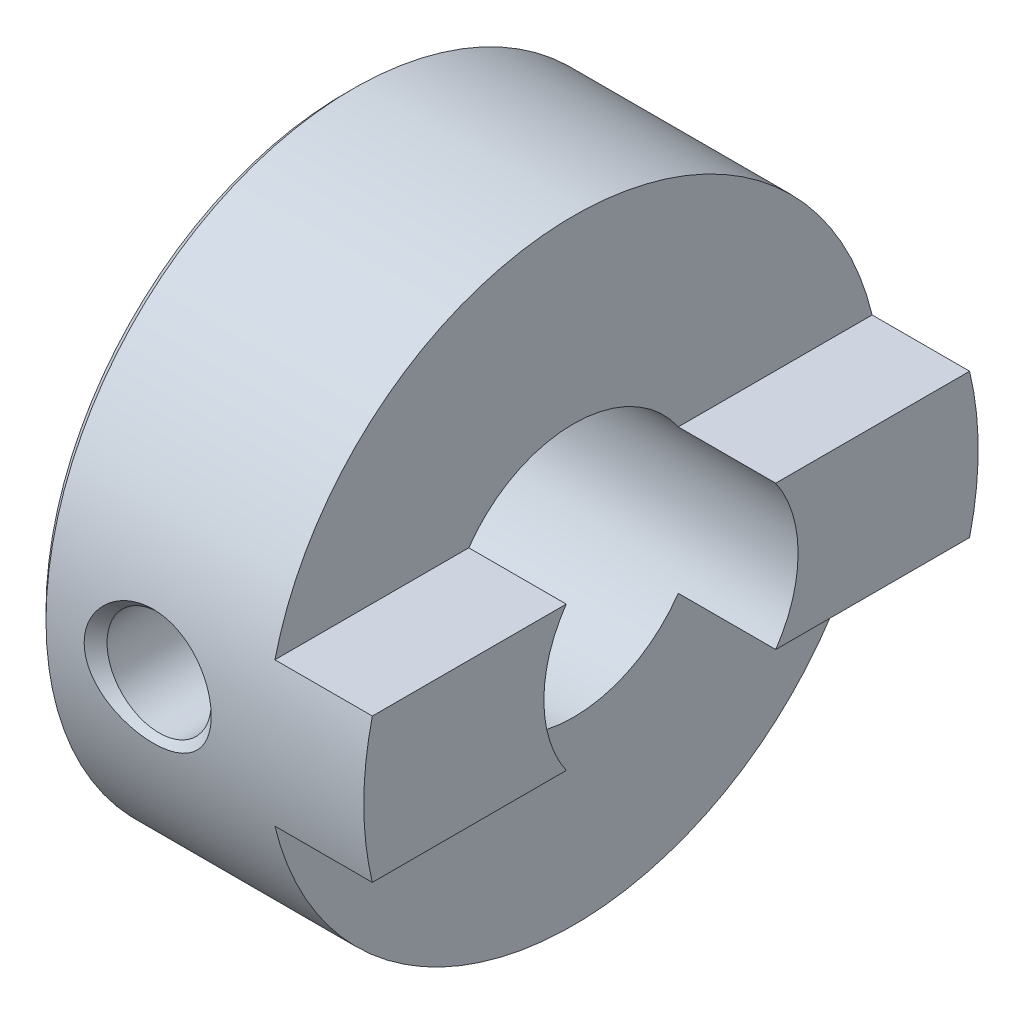
ISO-10303-21;
HEADER;
FILE_DESCRIPTION(('STEP AP214'),'2;1');
FILE_NAME('part.step','',(''),(''),'','','');
FILE_SCHEMA(('AUTOMOTIVE_DESIGN { 1 0 10303 214 1 1 1 1 }'));
ENDSEC;
DATA;
#1=APPLICATION_CONTEXT('core data for automotive mechanical design processes');
#2=APPLICATION_PROTOCOL_DEFINITION('international standard','automotive_design',2000,#1);
#3=PRODUCT_CONTEXT('',#1,'mechanical');
#4=PRODUCT('Part','Part','',(#3));
#5=PRODUCT_RELATED_PRODUCT_CATEGORY('part','',(#4));
#6=PRODUCT_DEFINITION_FORMATION('','',#4);
#7=PRODUCT_DEFINITION_CONTEXT('part definition',#1,'design');
#8=PRODUCT_DEFINITION('design','',#6,#7);
#9=PRODUCT_DEFINITION_SHAPE('','',#8);
#10=(LENGTH_UNIT() NAMED_UNIT(*) SI_UNIT(.MILLI.,.METRE.));
#11=(NAMED_UNIT(*) PLANE_ANGLE_UNIT() SI_UNIT($,.RADIAN.));
#12=(NAMED_UNIT(*) SI_UNIT($,.STERADIAN.) SOLID_ANGLE_UNIT());
#13=UNCERTAINTY_MEASURE_WITH_UNIT(LENGTH_MEASURE(1.E-05),#10,'distance_accuracy_value','');
#14=(GEOMETRIC_REPRESENTATION_CONTEXT(3) GLOBAL_UNCERTAINTY_ASSIGNED_CONTEXT((#13)) GLOBAL_UNIT_ASSIGNED_CONTEXT((#10,
#11,#12)) REPRESENTATION_CONTEXT('',''));
#15=CARTESIAN_POINT('',(0.,0.,0.));
#16=DIRECTION('',(0.,0.,1.));
#17=DIRECTION('',(1.,0.,0.));
#18=AXIS2_PLACEMENT_3D('',#15,#16,#17);
#19=CARTESIAN_POINT('',(7.7,0.,0.));
#20=DIRECTION('',(-1.,0.,0.));
#21=DIRECTION('',(0.,0.,1.));
#22=AXIS2_PLACEMENT_3D('',#19,#20,#21);
#23=CYLINDRICAL_SURFACE('',#22,3.);
#24=CARTESIAN_POINT('',(3.8295,0.,3.));
#25=CARTESIAN_POINT('',(3.82949328569729,-0.0659514535856203,2.99999498511311));
#26=CARTESIAN_POINT('',(3.82416188908903,-0.132011203774949,2.99779986227982));
#27=CARTESIAN_POINT('',(3.80302356475284,-0.262262647630673,2.98923181084605));
#28=CARTESIAN_POINT('',(3.78718881892747,-0.326448906785996,2.98284778843995));
#29=CARTESIAN_POINT('',(3.7457227192484,-0.450857222468448,2.96658875911719));
#30=CARTESIAN_POINT('',(3.72012409906108,-0.511091744949063,2.9567254249085));
#31=CARTESIAN_POINT('',(3.6599898195502,-0.626354649209973,2.93447272972049));
#32=CARTESIAN_POINT('',(3.62545703015189,-0.681384695087921,2.92208418018727));
#33=CARTESIAN_POINT('',(3.54664932062834,-0.78745356945694,2.89534823924166));
#34=CARTESIAN_POINT('',(3.50200813761405,-0.838204317616565,2.88093806799954));
#35=CARTESIAN_POINT('',(3.40502464860071,-0.931744853904246,2.85206114140614));
#36=CARTESIAN_POINT('',(3.35267843290376,-0.974530575298185,2.83759436097932));
#37=CARTESIAN_POINT('',(3.23877096037323,-1.05292091176569,2.80947961237513));
#38=CARTESIAN_POINT('',(3.17689120749616,-1.08809082515892,2.79590260625976));
#39=CARTESIAN_POINT('',(3.04745599561159,-1.14739431537322,2.77209579358365));
#40=CARTESIAN_POINT('',(2.97990338613743,-1.17153339430377,2.76186431901926));
#41=CARTESIAN_POINT('',(2.84435405685637,-1.20691045759755,2.74658421903306));
#42=CARTESIAN_POINT('',(2.77652760676489,-1.21870174053509,2.7413144936938));
#43=CARTESIAN_POINT('',(2.63966988744342,-1.23077568317597,2.73591659015033));
#44=CARTESIAN_POINT('',(2.57063927130691,-1.23106439849153,2.73578570656521));
#45=CARTESIAN_POINT('',(2.43876188563989,-1.22054280844032,2.74049253289023));
#46=CARTESIAN_POINT('',(2.37583434370652,-1.21054899967416,2.74496473839223));
#47=CARTESIAN_POINT('',(2.25264353626367,-1.18111223614475,2.7577579098135));
#48=CARTESIAN_POINT('',(2.19238076402581,-1.16166753986357,2.76607958506211));
#49=CARTESIAN_POINT('',(2.07473555597421,-1.1135051701494,2.78582002200623));
#50=CARTESIAN_POINT('',(2.01743983646983,-1.08460188146217,2.79729997649603));
#51=CARTESIAN_POINT('',(1.90829392084931,-1.01847361536098,2.82204815766591));
#52=CARTESIAN_POINT('',(1.8564458429203,-0.98124541847393,2.8353170753973));
#53=CARTESIAN_POINT('',(1.75521936998315,-0.895960018736876,2.86346450373987));
#54=CARTESIAN_POINT('',(1.70638673460735,-0.847267490537693,2.87838605601125));
#55=CARTESIAN_POINT('',(1.61740071573172,-0.742231634591019,2.90724204561816));
#56=CARTESIAN_POINT('',(1.57724923612441,-0.68588663295727,2.92117626596914));
#57=CARTESIAN_POINT('',(1.50600022647194,-0.565532668884167,2.94686865754846));
#58=CARTESIAN_POINT('',(1.47511776165605,-0.501384081860799,2.95857312748741));
#59=CARTESIAN_POINT('',(1.42477268422351,-0.368200328119309,2.97807769320191));
#60=CARTESIAN_POINT('',(1.40530397172419,-0.299167793691064,2.98587987416027));
#61=CARTESIAN_POINT('',(1.37946533079553,-0.162742348037352,2.99631517713848));
#62=CARTESIAN_POINT('',(1.37236256394674,-0.0955102741162197,2.99923703991062));
#63=CARTESIAN_POINT('',(1.36928128616072,0.0392426816075557,3.00049911766206));
#64=CARTESIAN_POINT('',(1.37329971205089,0.106763478770608,2.99884059424314));
#65=CARTESIAN_POINT('',(1.39181608520372,0.23679122112461,2.99131629784099));
#66=CARTESIAN_POINT('',(1.40580538199463,0.299383745656252,2.98565483728674));
#67=CARTESIAN_POINT('',(1.44316504071889,0.421269379771582,2.97090953103081));
#68=CARTESIAN_POINT('',(1.46653659677266,0.480562068276792,2.96182524970108));
#69=CARTESIAN_POINT('',(1.52276145063507,0.596230291018692,2.94076075800053));
#70=CARTESIAN_POINT('',(1.55588543647673,0.652459057517629,2.92869973207055));
#71=CARTESIAN_POINT('',(1.63037634033654,0.758760050709084,2.9029776109099));
#72=CARTESIAN_POINT('',(1.67174664717916,0.808829732601657,2.88931585881557));
#73=CARTESIAN_POINT('',(1.76490985805959,0.905031595838981,2.86070072959535));
#74=CARTESIAN_POINT('',(1.81722602257037,0.950651248882355,2.84572340909333));
#75=CARTESIAN_POINT('',(1.9290213940975,1.03259972531423,2.81702464968191));
#76=CARTESIAN_POINT('',(1.98850203231412,1.06892668781994,2.80330346266884));
#77=CARTESIAN_POINT('',(2.11402435079571,1.13158082456849,2.77861081388899));
#78=CARTESIAN_POINT('',(2.18013767424438,1.15777963115296,2.76767521401346));
#79=CARTESIAN_POINT('',(2.31642433649718,1.19845804973928,2.75030847354089));
#80=CARTESIAN_POINT('',(2.38659442725865,1.21294690178531,2.74387378192563));
#81=CARTESIAN_POINT('',(2.52333604792641,1.22889032551675,2.73676775095077));
#82=CARTESIAN_POINT('',(2.5897831564595,1.23124035133271,2.73570062793635));
#83=CARTESIAN_POINT('',(2.72208198363542,1.2252138393541,2.73840503500129));
#84=CARTESIAN_POINT('',(2.78793378545201,1.21683882409304,2.74217587828009));
#85=CARTESIAN_POINT('',(2.91422254722324,1.19034373537945,2.75377473340919));
#86=CARTESIAN_POINT('',(2.97477041948495,1.17266424718385,2.76141877653731));
#87=CARTESIAN_POINT('',(3.09205888491998,1.12848502186667,2.77976449429752));
#88=CARTESIAN_POINT('',(3.14879841030321,1.10198282333109,2.79046702208636));
#89=CARTESIAN_POINT('',(3.26050986673883,1.0391075640444,2.81450713105456));
#90=CARTESIAN_POINT('',(3.31518009342289,1.00224445147623,2.82796290964367));
#91=CARTESIAN_POINT('',(3.41783936132136,0.920392371525509,2.85565105030456));
#92=CARTESIAN_POINT('',(3.465826199865,0.875400736363273,2.86988366626076));
#93=CARTESIAN_POINT('',(3.5571832521007,0.774853209283579,2.89871006864603));
#94=CARTESIAN_POINT('',(3.60000102144758,0.718780498579465,2.91326023791293));
#95=CARTESIAN_POINT('',(3.6756405737496,0.599700811693502,2.94008128893798));
#96=CARTESIAN_POINT('',(3.7084577713653,0.536690672617394,2.95235112414249));
#97=CARTESIAN_POINT('',(3.7624274628876,0.406581660855322,2.97303819539227));
#98=CARTESIAN_POINT('',(3.78377377969354,0.339573482807291,2.98151900992786));
#99=CARTESIAN_POINT('',(3.81470588327966,0.202622479051472,2.99393275040676));
#100=CARTESIAN_POINT('',(3.82432870245358,0.132689619716405,2.99787999479812));
#101=CARTESIAN_POINT('',(3.82897175289518,0.0417015292291354,2.99978415049652));
#102=CARTESIAN_POINT('',(3.82950212329973,0.0208561797038032,3.00000158588441));
#103=CARTESIAN_POINT('',(3.8295,0.,3.));
#104=B_SPLINE_CURVE_WITH_KNOTS('',3,(#24,#25,#26,#27,#28,#29,#30,#31,#32,#33,#34,#35,#36,#37,
#38,#39,#40,#41,#42,#43,#44,#45,#46,#47,#48,#49,#50,#51,#52,#53,#54,#55,#56,#57,#58,#59,#60,#61,
#62,#63,#64,#65,#66,#67,#68,#69,#70,#71,#72,#73,#74,#75,#76,#77,#78,#79,#80,#81,#82,#83,#84,#85,
#86,#87,#88,#89,#90,#91,#92,#93,#94,#95,#96,#97,#98,#99,#100,#101,#102,#103),.UNSPECIFIED.,.T.,
.F.,(4,2,2,2,2,2,2,2,2,2,2,2,2,2,2,2,2,2,2,2,2,2,2,2,2,2,2,2,2,2,2,2,2,2,2,2,2,2,2,4),(0.,
0.197796476848555,0.39611892017699,0.593782244182593,0.791382151420799,0.997808518364824,
1.20433999386331,1.42062773745645,1.63680748003642,1.84282127729825,2.04872661563105,
2.23945548299843,2.43021950936491,2.62497735172079,2.81981064299796,3.03052449908558,
3.24128452074389,3.45661193569793,3.67182416748392,3.87378277467297,4.07568576080444,
4.26796477319144,4.46026826551681,4.65851435705458,4.85684208638467,5.06889934237754,
5.28099903014245,5.49570509764268,5.71024157987188,5.90870001466507,6.10713027929823,
6.29691314897361,6.48674900987517,6.68778307817334,6.88888324607283,7.10395632066562,
7.3191278600644,7.53053919959828,7.74128098311942,7.80383121729397),.UNSPECIFIED.);
#105=CARTESIAN_POINT('',(3.8295,0.,3.));
#106=VERTEX_POINT('',#105);
#107=EDGE_CURVE('E147',#106,#106,#104,.T.);
#108=ORIENTED_EDGE('',*,*,#107,.F.);
#109=EDGE_LOOP('',(#108));
#110=FACE_BOUND('',#109,.T.);
#111=CARTESIAN_POINT('',(0.,0.,0.));
#112=DIRECTION('',(-1.,0.,0.));
#113=DIRECTION('',(0.,0.,1.));
#114=AXIS2_PLACEMENT_3D('',#111,#112,#113);
#115=CIRCLE('',#114,3.);
#116=CARTESIAN_POINT('',(0.,0.,3.));
#117=VERTEX_POINT('',#116);
#118=EDGE_CURVE('E200',#117,#117,#115,.T.);
#119=ORIENTED_EDGE('',*,*,#118,.T.);
#120=EDGE_LOOP('',(#119));
#121=FACE_BOUND('',#120,.T.);
#122=DIRECTION('',(-1.,0.,0.));
#123=VECTOR('',#122,1.);
#124=CARTESIAN_POINT('',(7.7,1.7,-2.47184141886166));
#125=LINE('',#124,#123);
#126=CARTESIAN_POINT('',(5.4,1.7,-2.47184141886166));
#127=VERTEX_POINT('',#126);
#128=CARTESIAN_POINT('',(7.7,1.7,-2.47184141886166));
#129=VERTEX_POINT('',#128);
#130=EDGE_CURVE('E215',#127,#129,#125,.F.);
#131=ORIENTED_EDGE('',*,*,#130,.F.);
#132=CARTESIAN_POINT('',(5.4,0.,0.));
#133=DIRECTION('',(1.,0.,0.));
#134=DIRECTION('',(0.,0.,-1.));
#135=AXIS2_PLACEMENT_3D('',#132,#133,#134);
#136=CIRCLE('',#135,3.);
#137=CARTESIAN_POINT('',(5.4,1.7,2.47184141886165));
#138=VERTEX_POINT('',#137);
#139=EDGE_CURVE('E213',#138,#127,#136,.F.);
#140=ORIENTED_EDGE('',*,*,#139,.F.);
#141=DIRECTION('',(-1.,0.,0.));
#142=VECTOR('',#141,1.);
#143=CARTESIAN_POINT('',(7.7,1.7,2.47184141886166));
#144=LINE('',#143,#142);
#145=CARTESIAN_POINT('',(7.7,1.7,2.47184141886165));
#146=VERTEX_POINT('',#145);
#147=EDGE_CURVE('E217',#146,#138,#144,.T.);
#148=ORIENTED_EDGE('',*,*,#147,.F.);
#149=CARTESIAN_POINT('',(7.7,0.,0.));
#150=DIRECTION('',(-1.,0.,0.));
#151=DIRECTION('',(0.,0.,1.));
#152=AXIS2_PLACEMENT_3D('',#149,#150,#151);
#153=CIRCLE('',#152,3.);
#154=CARTESIAN_POINT('',(7.7,-1.7,2.47184141886166));
#155=VERTEX_POINT('',#154);
#156=EDGE_CURVE('E113',#155,#146,#153,.T.);
#157=ORIENTED_EDGE('',*,*,#156,.F.);
#158=DIRECTION('',(-1.,0.,0.));
#159=VECTOR('',#158,1.);
#160=CARTESIAN_POINT('',(7.7,-1.7,2.47184141886166));
#161=LINE('',#160,#159);
#162=CARTESIAN_POINT('',(5.4,-1.7,2.47184141886166));
#163=VERTEX_POINT('',#162);
#164=EDGE_CURVE('E122',#163,#155,#161,.F.);
#165=ORIENTED_EDGE('',*,*,#164,.F.);
#166=CARTESIAN_POINT('',(5.4,-1.7,-2.47184141886165));
#167=VERTEX_POINT('',#166);
#168=EDGE_CURVE('E212',#167,#163,#136,.F.);
#169=ORIENTED_EDGE('',*,*,#168,.F.);
#170=DIRECTION('',(-1.,0.,0.));
#171=VECTOR('',#170,1.);
#172=CARTESIAN_POINT('',(7.7,-1.7,-2.47184141886166));
#173=LINE('',#172,#171);
#174=CARTESIAN_POINT('',(7.7,-1.7,-2.47184141886165));
#175=VERTEX_POINT('',#174);
#176=EDGE_CURVE('E220',#175,#167,#173,.T.);
#177=ORIENTED_EDGE('',*,*,#176,.F.);
#178=EDGE_CURVE('E205',#129,#175,#153,.T.);
#179=ORIENTED_EDGE('',*,*,#178,.F.);
#180=EDGE_LOOP('',(#131,#140,#148,#157,#165,#169,#177,#179));
#181=FACE_BOUND('',#180,.T.);
#182=CARTESIAN_POINT('',(2.6,-2.73648127163334,-1.2295));
#183=CARTESIAN_POINT('',(2.53431241312503,-2.73648780956102,-1.22949315138636));
#184=CARTESIAN_POINT('',(2.46851319422433,-2.73888081381414,-1.22420253559425));
#185=CARTESIAN_POINT('',(2.33880712336176,-2.74815082242326,-1.20324134105429));
#186=CARTESIAN_POINT('',(2.27490599449168,-2.7550401822636,-1.18754215883488));
#187=CARTESIAN_POINT('',(2.15110367085302,-2.77238055395693,-1.14647156088477));
#188=CARTESIAN_POINT('',(2.09118763557545,-2.78281735069028,-1.1211387013557));
#189=CARTESIAN_POINT('',(1.97647410931836,-2.80605632232373,-1.06163271912682));
#190=CARTESIAN_POINT('',(1.92167529633033,-2.81885788373942,-1.02746188831969));
#191=CARTESIAN_POINT('',(1.81542071817095,-2.84624576616181,-0.949051485785524));
#192=CARTESIAN_POINT('',(1.76431030640095,-2.86089134904967,-0.904364397367615));
#193=CARTESIAN_POINT('',(1.67005477725144,-2.88982909756545,-0.80713037140368));
#194=CARTESIAN_POINT('',(1.62691267328353,-2.90412112772637,-0.754580473886261));
#195=CARTESIAN_POINT('',(1.54807767891041,-2.93145772839144,-0.640419420006656));
#196=CARTESIAN_POINT('',(1.51277069726217,-2.9444253707679,-0.578521678763456));
#197=CARTESIAN_POINT('',(1.45321911786677,-2.96692984694733,-0.449038294588409));
#198=CARTESIAN_POINT('',(1.42896976063041,-2.9764681564497,-0.381455113683014));
#199=CARTESIAN_POINT('',(1.39346522892795,-2.9906193808634,-0.246142515052299));
#200=CARTESIAN_POINT('',(1.3816152416405,-2.99545687164545,-0.178593132993614));
#201=CARTESIAN_POINT('',(1.36932659878579,-3.00047548879171,-0.0423030743211912));
#202=CARTESIAN_POINT('',(1.36888347302489,-3.00065843920655,0.0264371250591211));
#203=CARTESIAN_POINT('',(1.37910347278662,-2.99648142293689,0.158843065489902));
#204=CARTESIAN_POINT('',(1.38911381266895,-2.99238846675702,0.222569172880482));
#205=CARTESIAN_POINT('',(1.41884116729122,-2.98048340348736,0.347344524354358));
#206=CARTESIAN_POINT('',(1.43855889625975,-2.97267102273945,0.408393571110869));
#207=CARTESIAN_POINT('',(1.48737939882473,-2.9539364025768,0.527194669373116));
#208=CARTESIAN_POINT('',(1.51662024657542,-2.94296870578276,0.584882515233401));
#209=CARTESIAN_POINT('',(1.58352419889611,-2.91900300610779,0.694682900248777));
#210=CARTESIAN_POINT('',(1.62119024594535,-2.90600429437943,0.746793482135163));
#211=CARTESIAN_POINT('',(1.70687880484473,-2.87823614609434,0.847751806093453));
#212=CARTESIAN_POINT('',(1.7554340057339,-2.86340640811089,0.896131508323045));
#213=CARTESIAN_POINT('',(1.86001217848453,-2.8343238240614,0.984259463325257));
#214=CARTESIAN_POINT('',(1.91603783518033,-2.82007118781416,1.02400459932354));
#215=CARTESIAN_POINT('',(2.03616162862691,-2.7933344144319,1.09488169836433));
#216=CARTESIAN_POINT('',(2.10045577395076,-2.78091856857543,1.12570941449411));
#217=CARTESIAN_POINT('',(2.2339671151109,-2.76006895426521,1.17591116152427));
#218=CARTESIAN_POINT('',(2.30318088768675,-2.7516324474554,1.19529307110252));
#219=CARTESIAN_POINT('',(2.43988472631904,-2.74036973715095,1.22088420198514));
#220=CARTESIAN_POINT('',(2.50720623298238,-2.7372219875884,1.22785010777662));
#221=CARTESIAN_POINT('',(2.64211522756041,-2.73597518687805,1.23062760982761));
#222=CARTESIAN_POINT('',(2.70970262107327,-2.73787448144216,1.22644286097673));
#223=CARTESIAN_POINT('',(2.83888111137191,-2.74617645512611,1.20772776335379));
#224=CARTESIAN_POINT('',(2.90058637573323,-2.75229712124247,1.19384461620143));
#225=CARTESIAN_POINT('',(3.02074503827775,-2.76799616906696,1.15697694064485));
#226=CARTESIAN_POINT('',(3.07919768916748,-2.77757534161818,1.13399033047091));
#227=CARTESIAN_POINT('',(3.19390961953353,-2.79959890680042,1.07850341271678));
#228=CARTESIAN_POINT('',(3.24997620702377,-2.81214600076601,1.0456468007359));
#229=CARTESIAN_POINT('',(3.35606374580067,-2.83854133304941,0.971711039083268));
#230=CARTESIAN_POINT('',(3.40608212845281,-2.85239011978126,0.930628415410735));
#231=CARTESIAN_POINT('',(3.50272532461655,-2.88113667186629,0.837614583671576));
#232=CARTESIAN_POINT('',(3.54877820631948,-2.89603171091513,0.785085978357612));
#233=CARTESIAN_POINT('',(3.63151251873588,-2.92418051506077,0.672696462266431));
#234=CARTESIAN_POINT('',(3.66819339332496,-2.93743418273639,0.612835116684309));
#235=CARTESIAN_POINT('',(3.7310606384906,-2.9608738194617,0.487147930636997));
#236=CARTESIAN_POINT('',(3.7572328303714,-2.97105563929166,0.421314177733732));
#237=CARTESIAN_POINT('',(3.79794757318709,-2.98714826285554,0.28565560556214));
#238=CARTESIAN_POINT('',(3.81249679524442,-2.99306151638861,0.215833100375171));
#239=CARTESIAN_POINT('',(3.82873243582459,-2.99967730668242,0.0793006171973768));
#240=CARTESIAN_POINT('',(3.83122615829686,-3.00070679242164,0.0127017932051536));
#241=CARTESIAN_POINT('',(3.8254344745692,-2.99833483648245,-0.119937680644486));
#242=CARTESIAN_POINT('',(3.81715085126267,-2.99493412768981,-0.185978421006613));
#243=CARTESIAN_POINT('',(3.79061851146278,-2.98425243348016,-0.313353500594179));
#244=CARTESIAN_POINT('',(3.77271264038092,-2.97710514384663,-0.374771382452148));
#245=CARTESIAN_POINT('',(3.72781230848352,-2.95970663025144,-0.493713482444952));
#246=CARTESIAN_POINT('',(3.70081609297552,-2.94945480706587,-0.551236946270739));
#247=CARTESIAN_POINT('',(3.63714322694257,-2.92627386768644,-0.663595981273957));
#248=CARTESIAN_POINT('',(3.60008674047484,-2.91324530347192,-0.718195321073256));
#249=CARTESIAN_POINT('',(3.51790587513661,-2.88606626558856,-0.820630636830924));
#250=CARTESIAN_POINT('',(3.47277862443759,-2.87191539356856,-0.868464194428001));
#251=CARTESIAN_POINT('',(3.37225005788837,-2.84292750571023,-0.959261150448481));
#252=CARTESIAN_POINT('',(3.31636966936297,-2.82810618568879,-1.00170102773972));
#253=CARTESIAN_POINT('',(3.19780649473225,-2.8004263062305,-1.07666900848907));
#254=CARTESIAN_POINT('',(3.13511999885674,-2.78756882649604,-1.10919166926766));
#255=CARTESIAN_POINT('',(3.0050168237469,-2.76555425774474,-1.16299317926956));
#256=CARTESIAN_POINT('',(2.93763760992313,-2.7563710936226,-1.18435160089751));
#257=CARTESIAN_POINT('',(2.79987605050722,-2.74292337613586,-1.21518173856348));
#258=CARTESIAN_POINT('',(2.72950460802761,-2.73864232698964,-1.22469332912189));
#259=CARTESIAN_POINT('',(2.63929212566052,-2.73669093986595,-1.22903121983948));
#260=CARTESIAN_POINT('',(2.61965105815903,-2.7364793157509,-1.22950204882705));
#261=CARTESIAN_POINT('',(2.6,-2.73648127163334,-1.2295));
#262=B_SPLINE_CURVE_WITH_KNOTS('',3,(#182,#183,#184,#185,#186,#187,#188,#189,#190,#191,#192,
#193,#194,#195,#196,#197,#198,#199,#200,#201,#202,#203,#204,#205,#206,#207,#208,#209,#210,#211,
#212,#213,#214,#215,#216,#217,#218,#219,#220,#221,#222,#223,#224,#225,#226,#227,#228,#229,#230,
#231,#232,#233,#234,#235,#236,#237,#238,#239,#240,#241,#242,#243,#244,#245,#246,#247,#248,#249,
#250,#251,#252,#253,#254,#255,#256,#257,#258,#259,#260,#261),.UNSPECIFIED.,.T.,.F.,(4,2,2,2,2,2,
2,2,2,2,2,2,2,2,2,2,2,2,2,2,2,2,2,2,2,2,2,2,2,2,2,2,2,2,2,2,2,2,2,4),(0.,0.197007966215397,
0.394559580690225,0.591328730081259,0.788046903701635,0.995494474616981,1.20302033701821,
1.41920485860491,1.63529624071189,1.84046581601936,2.04555498694063,2.23856134929523,
2.43158191436346,2.62753588803081,2.8235584052722,3.03300883122902,3.24253473625559,
3.45853784628883,3.67439209755867,3.87657241302121,4.07868646727745,4.26846135135183,
4.45827965801603,4.65600225587178,4.85380853252234,5.06709525389456,5.28039462852351,
5.49398083506075,5.70744436335558,5.90639415816304,6.10531104494405,6.29756953893313,
6.48986516551972,6.69078450728953,6.89177548516159,7.10591887553852,7.32017957956198,
7.53289158239508,7.74488567905244,7.80382246126762),.UNSPECIFIED.);
#263=CARTESIAN_POINT('',(2.6,-2.73648127163334,-1.2295));
#264=VERTEX_POINT('',#263);
#265=EDGE_CURVE('E35',#264,#264,#262,.T.);
#266=ORIENTED_EDGE('',*,*,#265,.F.);
#267=EDGE_LOOP('',(#266));
#268=FACE_BOUND('',#267,.T.);
#269=ADVANCED_FACE('F31',(#110,#121,#181,#268),#23,.F.);
#270=CARTESIAN_POINT('',(7.7,0.,0.));
#271=DIRECTION('',(-1.,0.,0.));
#272=DIRECTION('',(0.,0.,1.));
#273=AXIS2_PLACEMENT_3D('',#270,#271,#272);
#274=CYLINDRICAL_SURFACE('',#273,7.25);
#275=CARTESIAN_POINT('',(1.58200830564529,-1.00441187640881,7.18008752364289));
#276=CARTESIAN_POINT('',(1.63578489278405,-1.04986168617137,7.17372987099769));
#277=CARTESIAN_POINT('',(1.69285744622883,-1.0914437843685,7.16747414093581));
#278=CARTESIAN_POINT('',(1.81228966583431,-1.16634368468239,7.15566782402923));
#279=CARTESIAN_POINT('',(1.87465392529839,-1.19965420638385,7.15011786046206));
#280=CARTESIAN_POINT('',(2.01679932362037,-1.26362766588196,7.13911876735613));
#281=CARTESIAN_POINT('',(2.09750518380208,-1.29229902644037,7.13393068599323));
#282=CARTESIAN_POINT('',(2.26255781731959,-1.33649004443632,7.12578417882237));
#283=CARTESIAN_POINT('',(2.34690619475528,-1.35200384414861,7.12282674616046));
#284=CARTESIAN_POINT('',(2.52065223150985,-1.36998996712848,7.11939043620564));
#285=CARTESIAN_POINT('',(2.61011263231742,-1.37188343237519,7.11902158797866));
#286=CARTESIAN_POINT('',(2.78811433738971,-1.36105760290706,7.12109896292041));
#287=CARTESIAN_POINT('',(2.87665557697855,-1.34833728684657,7.12354538284604));
#288=CARTESIAN_POINT('',(3.05121935555725,-1.30830613276614,7.13100637247181));
#289=CARTESIAN_POINT('',(3.13720746776744,-1.2808493751554,7.13604660507981));
#290=CARTESIAN_POINT('',(3.30315769567977,-1.21173912671794,7.14810554203639));
#291=CARTESIAN_POINT('',(3.38311937379568,-1.17008460618597,7.15512438987939));
#292=CARTESIAN_POINT('',(3.53281939111721,-1.07436014228975,7.17011449381119));
#293=CARTESIAN_POINT('',(3.60273478873325,-1.02056442954647,7.17806308179058));
#294=CARTESIAN_POINT('',(3.73168457584752,-0.901188410845225,7.19402326752565));
#295=CARTESIAN_POINT('',(3.79072313502557,-0.835612639940881,7.20203483990277));
#296=CARTESIAN_POINT('',(3.89176983510201,-0.699065767687178,7.21652215909619));
#297=CARTESIAN_POINT('',(3.9346557785529,-0.628753310889177,7.22306493275218));
#298=CARTESIAN_POINT('',(4.00658864830554,-0.481245793876791,7.23438650365962));
#299=CARTESIAN_POINT('',(4.03564736039825,-0.404056661946941,7.23916680239026));
#300=CARTESIAN_POINT('',(4.07618067207471,-0.253293693342394,7.24592730796786));
#301=CARTESIAN_POINT('',(4.08911394050319,-0.180121088254738,7.24813828678803));
#302=CARTESIAN_POINT('',(4.10176888975318,-0.0326184047054376,7.25030100569326));
#303=CARTESIAN_POINT('',(4.10149631308732,0.041711156601682,7.25025372777298));
#304=CARTESIAN_POINT('',(4.08820817586898,0.184383945543079,7.24798414988832));
#305=CARTESIAN_POINT('',(4.07600481823865,0.252807068196405,7.24590048292978));
#306=CARTESIAN_POINT('',(4.04060949728902,0.386657988093955,7.23999211790296));
#307=CARTESIAN_POINT('',(4.01741713207762,0.452085675692575,7.23616735615924));
#308=CARTESIAN_POINT('',(3.96051204781662,0.579435634433251,7.22709524930008));
#309=CARTESIAN_POINT('',(3.92662374278215,0.64127736804729,7.22182436848898));
#310=CARTESIAN_POINT('',(3.8497192608264,0.758894573948918,7.21041449239855));
#311=CARTESIAN_POINT('',(3.80670040557847,0.814668258977202,7.20427524257127));
#312=CARTESIAN_POINT('',(3.70914137095142,0.923325338320132,7.19118919407236));
#313=CARTESIAN_POINT('',(3.65395734780279,0.975626981988899,7.18421698925729));
#314=CARTESIAN_POINT('',(3.53619073599058,1.07114619999515,7.17059821491746));
#315=CARTESIAN_POINT('',(3.47360525829482,1.11436020872209,7.16395177399041));
#316=CARTESIAN_POINT('',(3.33665332172002,1.19458953746153,7.15103215175697));
#317=CARTESIAN_POINT('',(3.26173286710323,1.23067513006905,7.14484885376223));
#318=CARTESIAN_POINT('',(3.10705718425124,1.29069806927207,7.13425045930504));
#319=CARTESIAN_POINT('',(3.02730052661362,1.31463180444377,7.12983588857469));
#320=CARTESIAN_POINT('',(2.8600321862052,1.35105018722601,7.12302843823919));
#321=CARTESIAN_POINT('',(2.77234356407695,1.36275222818191,7.1207744451249));
#322=CARTESIAN_POINT('',(2.59619523462123,1.37185894546039,7.11902547397831));
#323=CARTESIAN_POINT('',(2.50773540865226,1.36926138175978,7.11953092821143));
#324=CARTESIAN_POINT('',(2.33061126879319,1.34960613141039,7.12328338346153));
#325=CARTESIAN_POINT('',(2.24198131585001,1.33224738498813,7.12658745781934));
#326=CARTESIAN_POINT('',(2.06897237582656,1.28297633307368,7.13562151934399));
#327=CARTESIAN_POINT('',(1.98459381058273,1.25106258653289,7.14135174671321));
#328=CARTESIAN_POINT('',(1.82339727023525,1.17360665959709,7.15448608356551));
#329=CARTESIAN_POINT('',(1.74651841092376,1.12818895340395,7.16187475988556));
#330=CARTESIAN_POINT('',(1.60205504614399,1.02447186153392,7.17744361372084));
#331=CARTESIAN_POINT('',(1.53446899231729,0.966174626061896,7.18562365899105));
#332=CARTESIAN_POINT('',(1.41434197676091,0.841167557071238,7.20129836482031));
#333=CARTESIAN_POINT('',(1.36122070886127,0.775018991504764,7.20880689105407));
#334=CARTESIAN_POINT('',(1.26817419775783,0.63389110916314,7.22258155112997));
#335=CARTESIAN_POINT('',(1.22823870201042,0.558918715143412,7.22884864871574));
#336=CARTESIAN_POINT('',(1.16673090415709,0.409859581690512,7.23875387776177));
#337=CARTESIAN_POINT('',(1.1437848535595,0.336352629089151,7.2425838198878));
#338=CARTESIAN_POINT('',(1.11166697875233,0.186318789306052,7.24799293238601));
#339=CARTESIAN_POINT('',(1.10248608704101,0.109793924240928,7.2495735843946));
#340=CARTESIAN_POINT('',(1.09856708002886,-0.0371624105618861,7.2502458733885));
#341=CARTESIAN_POINT('',(1.10267880857037,-0.107564850675874,7.24953573502622));
#342=CARTESIAN_POINT('',(1.12266051183263,-0.246628476202496,7.24613765697439));
#343=CARTESIAN_POINT('',(1.1385305372985,-0.315289654099066,7.24344970874923));
#344=CARTESIAN_POINT('',(1.18105536096362,-0.44820883014545,7.23643532002251));
#345=CARTESIAN_POINT('',(1.20758616009768,-0.512507843662707,7.23212775367172));
#346=CARTESIAN_POINT('',(1.27036332146251,-0.636038184498317,7.22231246455589));
#347=CARTESIAN_POINT('',(1.30660754976289,-0.69527062112042,7.21680500544335));
#348=CARTESIAN_POINT('',(1.38084391813178,-0.79820968952281,7.20607963615762));
#349=CARTESIAN_POINT('',(1.4175529831974,-0.842863136661078,7.2009647742634));
#350=CARTESIAN_POINT('',(1.49610740984216,-0.927346361084062,7.19057295923222));
#351=CARTESIAN_POINT('',(1.5379517769681,-0.967177069335422,7.18529603762613));
#352=CARTESIAN_POINT('',(1.58200830564529,-1.00441187640881,7.18008752364289));
#353=B_SPLINE_CURVE_WITH_KNOTS('',3,(#275,#276,#277,#278,#279,#280,#281,#282,#283,#284,#285,
#286,#287,#288,#289,#290,#291,#292,#293,#294,#295,#296,#297,#298,#299,#300,#301,#302,#303,#304,
#305,#306,#307,#308,#309,#310,#311,#312,#313,#314,#315,#316,#317,#318,#319,#320,#321,#322,#323,
#324,#325,#326,#327,#328,#329,#330,#331,#332,#333,#334,#335,#336,#337,#338,#339,#340,#341,#342,
#343,#344,#345,#346,#347,#348,#349,#350,#351,#352),.UNSPECIFIED.,.T.,.F.,(4,2,2,2,2,2,2,2,2,2,2,
2,2,2,2,2,2,2,2,2,2,2,2,2,2,2,2,2,2,2,2,2,2,2,2,2,2,2,4),(0.,0.211938643284731,
0.424063173171912,0.680306178414661,0.936663202843584,1.20385421472871,1.47106390151892,
1.74096966424346,2.01089500628775,2.27524467692895,2.53949279622624,2.78598439679511,
3.03226551954191,3.25410969475752,3.47585740272509,3.68349073542137,3.89113166230997,
4.10237599855491,4.31368238639661,4.54177808574879,4.76996311408858,5.01903918441396,
5.268189234664,5.5324533792992,5.79675892190776,6.06658804235083,6.33644388359847,
6.60388559171092,6.87128268480002,7.12540591048332,7.37933107579475,7.60937608477173,
7.83926948987682,8.04982077901012,8.26037297682207,8.46854395674077,8.67666924128815,
8.85033378723575,9.02396475588732),.UNSPECIFIED.);
#354=CARTESIAN_POINT('',(1.58200830564529,-1.00441187640881,7.18008752364289));
#355=VERTEX_POINT('',#354);
#356=EDGE_CURVE('E44',#355,#355,#353,.T.);
#357=ORIENTED_EDGE('',*,*,#356,.F.);
#358=EDGE_LOOP('',(#357));
#359=FACE_BOUND('',#358,.T.);
#360=CARTESIAN_POINT('',(0.2,0.,0.));
#361=DIRECTION('',(-1.,0.,0.));
#362=DIRECTION('',(0.,0.,1.));
#363=AXIS2_PLACEMENT_3D('',#360,#361,#362);
#364=CIRCLE('',#363,7.25);
#365=CARTESIAN_POINT('',(0.2,0.,7.25));
#366=VERTEX_POINT('',#365);
#367=EDGE_CURVE('E209',#366,#366,#364,.T.);
#368=ORIENTED_EDGE('',*,*,#367,.F.);
#369=EDGE_LOOP('',(#368));
#370=FACE_BOUND('',#369,.T.);
#371=DIRECTION('',(-1.,0.,0.));
#372=VECTOR('',#371,1.);
#373=CARTESIAN_POINT('',(7.7,1.7,-7.04787201926936));
#374=LINE('',#373,#372);
#375=CARTESIAN_POINT('',(7.7,1.7,-7.04787201926936));
#376=VERTEX_POINT('',#375);
#377=CARTESIAN_POINT('',(5.4,1.7,-7.04787201926936));
#378=VERTEX_POINT('',#377);
#379=EDGE_CURVE('E139',#376,#378,#374,.T.);
#380=ORIENTED_EDGE('',*,*,#379,.F.);
#381=CARTESIAN_POINT('',(7.7,0.,0.));
#382=DIRECTION('',(-1.,0.,0.));
#383=DIRECTION('',(0.,0.,1.));
#384=AXIS2_PLACEMENT_3D('',#381,#382,#383);
#385=CIRCLE('',#384,7.25);
#386=CARTESIAN_POINT('',(7.7,-1.7,-7.04787201926936));
#387=VERTEX_POINT('',#386);
#388=EDGE_CURVE('E114',#376,#387,#385,.T.);
#389=ORIENTED_EDGE('',*,*,#388,.T.);
#390=DIRECTION('',(-1.,0.,0.));
#391=VECTOR('',#390,1.);
#392=CARTESIAN_POINT('',(7.7,-1.7,-7.04787201926936));
#393=LINE('',#392,#391);
#394=CARTESIAN_POINT('',(5.4,-1.7,-7.04787201926936));
#395=VERTEX_POINT('',#394);
#396=EDGE_CURVE('E135',#395,#387,#393,.F.);
#397=ORIENTED_EDGE('',*,*,#396,.F.);
#398=CARTESIAN_POINT('',(5.4,0.,0.));
#399=DIRECTION('',(1.,0.,0.));
#400=DIRECTION('',(0.,0.,-1.));
#401=AXIS2_PLACEMENT_3D('',#398,#399,#400);
#402=CIRCLE('',#401,7.25);
#403=CARTESIAN_POINT('',(5.4,-1.7,7.04787201926936));
#404=VERTEX_POINT('',#403);
#405=EDGE_CURVE('E130',#404,#395,#402,.T.);
#406=ORIENTED_EDGE('',*,*,#405,.F.);
#407=DIRECTION('',(-1.,0.,0.));
#408=VECTOR('',#407,1.);
#409=CARTESIAN_POINT('',(7.7,-1.7,7.04787201926936));
#410=LINE('',#409,#408);
#411=CARTESIAN_POINT('',(7.7,-1.7,7.04787201926936));
#412=VERTEX_POINT('',#411);
#413=EDGE_CURVE('E119',#412,#404,#410,.T.);
#414=ORIENTED_EDGE('',*,*,#413,.F.);
#415=CARTESIAN_POINT('',(7.7,1.7,7.04787201926936));
#416=VERTEX_POINT('',#415);
#417=EDGE_CURVE('E103',#412,#416,#385,.T.);
#418=ORIENTED_EDGE('',*,*,#417,.T.);
#419=DIRECTION('',(-1.,0.,0.));
#420=VECTOR('',#419,1.);
#421=CARTESIAN_POINT('',(7.7,1.7,7.04787201926936));
#422=LINE('',#421,#420);
#423=CARTESIAN_POINT('',(5.4,1.7,7.04787201926936));
#424=VERTEX_POINT('',#423);
#425=EDGE_CURVE('E131',#424,#416,#422,.F.);
#426=ORIENTED_EDGE('',*,*,#425,.F.);
#427=EDGE_CURVE('E133',#378,#424,#402,.T.);
#428=ORIENTED_EDGE('',*,*,#427,.F.);
#429=EDGE_LOOP('',(#380,#389,#397,#406,#414,#418,#426,#428));
#430=FACE_BOUND('',#429,.T.);
#431=CARTESIAN_POINT('',(1.58200830564529,-7.18008752364289,-1.00441187640881));
#432=CARTESIAN_POINT('',(1.63578489278405,-7.17372987099769,-1.04986168617137));
#433=CARTESIAN_POINT('',(1.69285744622883,-7.16747414093581,-1.0914437843685));
#434=CARTESIAN_POINT('',(1.81228966583431,-7.15566782402923,-1.16634368468239));
#435=CARTESIAN_POINT('',(1.87465392529839,-7.15011786046206,-1.19965420638385));
#436=CARTESIAN_POINT('',(2.01679932362037,-7.13911876735613,-1.26362766588195));
#437=CARTESIAN_POINT('',(2.09750518380208,-7.13393068599323,-1.29229902644037));
#438=CARTESIAN_POINT('',(2.26255781731959,-7.12578417882237,-1.33649004443632));
#439=CARTESIAN_POINT('',(2.34690619475528,-7.12282674616046,-1.35200384414861));
#440=CARTESIAN_POINT('',(2.52065223150985,-7.11939043620564,-1.36998996712848));
#441=CARTESIAN_POINT('',(2.61011263231742,-7.11902158797866,-1.37188343237519));
#442=CARTESIAN_POINT('',(2.78811433738971,-7.12109896292041,-1.36105760290706));
#443=CARTESIAN_POINT('',(2.87665557697855,-7.12354538284604,-1.34833728684657));
#444=CARTESIAN_POINT('',(3.05121935555725,-7.13100637247181,-1.30830613276614));
#445=CARTESIAN_POINT('',(3.13720746776744,-7.13604660507981,-1.2808493751554));
#446=CARTESIAN_POINT('',(3.30315769567977,-7.14810554203639,-1.21173912671794));
#447=CARTESIAN_POINT('',(3.38311937379568,-7.15512438987939,-1.17008460618597));
#448=CARTESIAN_POINT('',(3.5328193911172,-7.17011449381119,-1.07436014228975));
#449=CARTESIAN_POINT('',(3.60273478873325,-7.17806308179058,-1.02056442954647));
#450=CARTESIAN_POINT('',(3.73168457584752,-7.19402326752565,-0.901188410845225));
#451=CARTESIAN_POINT('',(3.79072313502557,-7.20203483990277,-0.835612639940882));
#452=CARTESIAN_POINT('',(3.89176983510201,-7.21652215909619,-0.699065767687178));
#453=CARTESIAN_POINT('',(3.9346557785529,-7.22306493275218,-0.628753310889178));
#454=CARTESIAN_POINT('',(4.00658864830554,-7.23438650365962,-0.481245793876792));
#455=CARTESIAN_POINT('',(4.03564736039825,-7.23916680239026,-0.404056661946942));
#456=CARTESIAN_POINT('',(4.07618067207471,-7.24592730796786,-0.253293693342395));
#457=CARTESIAN_POINT('',(4.08911394050318,-7.24813828678803,-0.180121088254738));
#458=CARTESIAN_POINT('',(4.10176888975318,-7.25030100569326,-0.0326184047054377));
#459=CARTESIAN_POINT('',(4.10149631308732,-7.25025372777298,0.0417111566016818));
#460=CARTESIAN_POINT('',(4.08820817586898,-7.24798414988832,0.184383945543078));
#461=CARTESIAN_POINT('',(4.07600481823865,-7.24590048292978,0.252807068196405));
#462=CARTESIAN_POINT('',(4.04060949728902,-7.23999211790296,0.386657988093955));
#463=CARTESIAN_POINT('',(4.01741713207762,-7.23616735615924,0.452085675692574));
#464=CARTESIAN_POINT('',(3.96051204781662,-7.22709524930008,0.579435634433251));
#465=CARTESIAN_POINT('',(3.92662374278215,-7.22182436848898,0.64127736804729));
#466=CARTESIAN_POINT('',(3.8497192608264,-7.21041449239855,0.758894573948917));
#467=CARTESIAN_POINT('',(3.80670040557847,-7.20427524257127,0.814668258977201));
#468=CARTESIAN_POINT('',(3.70914137095142,-7.19118919407236,0.923325338320132));
#469=CARTESIAN_POINT('',(3.65395734780279,-7.18421698925729,0.975626981988899));
#470=CARTESIAN_POINT('',(3.53619073599058,-7.17059821491746,1.07114619999515));
#471=CARTESIAN_POINT('',(3.47360525829482,-7.16395177399041,1.11436020872209));
#472=CARTESIAN_POINT('',(3.33665332172002,-7.15103215175697,1.19458953746153));
#473=CARTESIAN_POINT('',(3.26173286710323,-7.14484885376223,1.23067513006905));
#474=CARTESIAN_POINT('',(3.10705718425124,-7.13425045930504,1.29069806927207));
#475=CARTESIAN_POINT('',(3.02730052661362,-7.12983588857469,1.31463180444377));
#476=CARTESIAN_POINT('',(2.8600321862052,-7.12302843823919,1.35105018722601));
#477=CARTESIAN_POINT('',(2.77234356407695,-7.1207744451249,1.36275222818191));
#478=CARTESIAN_POINT('',(2.59619523462123,-7.11902547397831,1.37185894546039));
#479=CARTESIAN_POINT('',(2.50773540865226,-7.11953092821143,1.36926138175978));
#480=CARTESIAN_POINT('',(2.33061126879319,-7.12328338346153,1.34960613141039));
#481=CARTESIAN_POINT('',(2.24198131585001,-7.12658745781934,1.33224738498813));
#482=CARTESIAN_POINT('',(2.06897237582656,-7.13562151934399,1.28297633307368));
#483=CARTESIAN_POINT('',(1.98459381058273,-7.14135174671321,1.25106258653289));
#484=CARTESIAN_POINT('',(1.82339727023525,-7.15448608356551,1.17360665959709));
#485=CARTESIAN_POINT('',(1.74651841092376,-7.16187475988556,1.12818895340395));
#486=CARTESIAN_POINT('',(1.602055046144,-7.17744361372084,1.02447186153392));
#487=CARTESIAN_POINT('',(1.53446899231729,-7.18562365899105,0.966174626061897));
#488=CARTESIAN_POINT('',(1.41434197676091,-7.20129836482031,0.84116755707124));
#489=CARTESIAN_POINT('',(1.36122070886127,-7.20880689105407,0.775018991504765));
#490=CARTESIAN_POINT('',(1.26817419775783,-7.22258155112997,0.633891109163142));
#491=CARTESIAN_POINT('',(1.22823870201042,-7.22884864871574,0.558918715143413));
#492=CARTESIAN_POINT('',(1.16673090415709,-7.23875387776177,0.409859581690513));
#493=CARTESIAN_POINT('',(1.1437848535595,-7.2425838198878,0.336352629089152));
#494=CARTESIAN_POINT('',(1.11166697875233,-7.24799293238601,0.186318789306053));
#495=CARTESIAN_POINT('',(1.10248608704101,-7.2495735843946,0.109793924240929));
#496=CARTESIAN_POINT('',(1.09856708002886,-7.2502458733885,-0.0371624105618858));
#497=CARTESIAN_POINT('',(1.10267880857037,-7.24953573502622,-0.107564850675874));
#498=CARTESIAN_POINT('',(1.12266051183263,-7.24613765697439,-0.246628476202496));
#499=CARTESIAN_POINT('',(1.1385305372985,-7.24344970874923,-0.315289654099065));
#500=CARTESIAN_POINT('',(1.18105536096362,-7.23643532002251,-0.448208830145449));
#501=CARTESIAN_POINT('',(1.20758616009768,-7.23212775367172,-0.512507843662706));
#502=CARTESIAN_POINT('',(1.27036332146251,-7.22231246455589,-0.636038184498316));
#503=CARTESIAN_POINT('',(1.3066075497629,-7.21680500544335,-0.695270621120419));
#504=CARTESIAN_POINT('',(1.38084391813178,-7.20607963615762,-0.798209689522809));
#505=CARTESIAN_POINT('',(1.4175529831974,-7.2009647742634,-0.842863136661076));
#506=CARTESIAN_POINT('',(1.49610740984216,-7.19057295923222,-0.927346361084061));
#507=CARTESIAN_POINT('',(1.5379517769681,-7.18529603762613,-0.967177069335421));
#508=CARTESIAN_POINT('',(1.58200830564529,-7.18008752364289,-1.00441187640881));
#509=B_SPLINE_CURVE_WITH_KNOTS('',3,(#431,#432,#433,#434,#435,#436,#437,#438,#439,#440,#441,
#442,#443,#444,#445,#446,#447,#448,#449,#450,#451,#452,#453,#454,#455,#456,#457,#458,#459,#460,
#461,#462,#463,#464,#465,#466,#467,#468,#469,#470,#471,#472,#473,#474,#475,#476,#477,#478,#479,
#480,#481,#482,#483,#484,#485,#486,#487,#488,#489,#490,#491,#492,#493,#494,#495,#496,#497,#498,
#499,#500,#501,#502,#503,#504,#505,#506,#507,#508),.UNSPECIFIED.,.T.,.F.,(4,2,2,2,2,2,2,2,2,2,2,
2,2,2,2,2,2,2,2,2,2,2,2,2,2,2,2,2,2,2,2,2,2,2,2,2,2,2,4),(0.,0.211938643284731,
0.424063173171911,0.68030617841466,0.936663202843583,1.20385421472871,1.47106390151892,
1.74096966424346,2.01089500628775,2.27524467692895,2.53949279622623,2.78598439679511,
3.0322655195419,3.25410969475752,3.47585740272509,3.68349073542137,3.89113166230996,
4.10237599855491,4.31368238639661,4.54177808574879,4.76996311408858,5.01903918441396,
5.268189234664,5.53245337929919,5.79675892190776,6.06658804235083,6.33644388359846,
6.60388559171092,6.87128268480002,7.12540591048331,7.37933107579475,7.60937608477172,
7.83926948987682,8.04982077901012,8.26037297682207,8.46854395674077,8.67666924128815,
8.85033378723574,9.02396475588731),.UNSPECIFIED.);
#510=CARTESIAN_POINT('',(1.58200830564529,-7.18008752364289,-1.00441187640881));
#511=VERTEX_POINT('',#510);
#512=EDGE_CURVE('E11',#511,#511,#509,.T.);
#513=ORIENTED_EDGE('',*,*,#512,.F.);
#514=EDGE_LOOP('',(#513));
#515=FACE_BOUND('',#514,.T.);
#516=ADVANCED_FACE('F127',(#359,#370,#430,#515),#274,.T.);
#517=CARTESIAN_POINT('',(7.7,3.,0.));
#518=DIRECTION('',(-1.,0.,0.));
#519=DIRECTION('',(0.,0.,1.));
#520=AXIS2_PLACEMENT_3D('',#517,#518,#519);
#521=PLANE('',#520);
#522=DIRECTION('',(0.,0.,1.));
#523=VECTOR('',#522,1.);
#524=CARTESIAN_POINT('',(7.7,1.7,-7.25));
#525=LINE('',#524,#523);
#526=EDGE_CURVE('E109',#146,#416,#525,.T.);
#527=ORIENTED_EDGE('',*,*,#526,.T.);
#528=ORIENTED_EDGE('',*,*,#417,.F.);
#529=DIRECTION('',(0.,0.,-1.));
#530=VECTOR('',#529,1.);
#531=CARTESIAN_POINT('',(7.7,-1.7,7.25));
#532=LINE('',#531,#530);
#533=EDGE_CURVE('E107',#412,#155,#532,.T.);
#534=ORIENTED_EDGE('',*,*,#533,.T.);
#535=ORIENTED_EDGE('',*,*,#156,.T.);
#536=EDGE_LOOP('',(#527,#528,#534,#535));
#537=FACE_BOUND('',#536,.T.);
#538=ADVANCED_FACE('F105',(#537),#521,.F.);
#539=EDGE_CURVE('E224',#376,#129,#525,.T.);
#540=ORIENTED_EDGE('',*,*,#539,.T.);
#541=ORIENTED_EDGE('',*,*,#178,.T.);
#542=EDGE_CURVE('E123',#175,#387,#532,.T.);
#543=ORIENTED_EDGE('',*,*,#542,.T.);
#544=ORIENTED_EDGE('',*,*,#388,.F.);
#545=EDGE_LOOP('',(#540,#541,#543,#544));
#546=FACE_BOUND('',#545,.T.);
#547=ADVANCED_FACE('F195',(#546),#521,.F.);
#548=CARTESIAN_POINT('',(0.2,0.,0.));
#549=DIRECTION('',(1.,0.,0.));
#550=DIRECTION('',(0.,0.,-1.));
#551=AXIS2_PLACEMENT_3D('',#548,#549,#550);
#552=CONICAL_SURFACE('',#551,7.25,0.78539816339745);
#553=CARTESIAN_POINT('',(0.,0.,0.));
#554=DIRECTION('',(-1.,0.,0.));
#555=DIRECTION('',(0.,0.,1.));
#556=AXIS2_PLACEMENT_3D('',#553,#554,#555);
#557=CIRCLE('',#556,7.05);
#558=CARTESIAN_POINT('',(0.,0.,7.05));
#559=VERTEX_POINT('',#558);
#560=EDGE_CURVE('E203',#559,#559,#557,.T.);
#561=ORIENTED_EDGE('',*,*,#560,.F.);
#562=EDGE_LOOP('',(#561));
#563=FACE_BOUND('',#562,.T.);
#564=ORIENTED_EDGE('',*,*,#367,.T.);
#565=EDGE_LOOP('',(#564));
#566=FACE_BOUND('',#565,.T.);
#567=ADVANCED_FACE('F33',(#563,#566),#552,.T.);
#568=CARTESIAN_POINT('',(0.,7.05,0.));
#569=DIRECTION('',(1.,0.,0.));
#570=DIRECTION('',(0.,0.,-1.));
#571=AXIS2_PLACEMENT_3D('',#568,#569,#570);
#572=PLANE('',#571);
#573=ORIENTED_EDGE('',*,*,#118,.F.);
#574=EDGE_LOOP('',(#573));
#575=FACE_BOUND('',#574,.T.);
#576=ORIENTED_EDGE('',*,*,#560,.T.);
#577=EDGE_LOOP('',(#576));
#578=FACE_BOUND('',#577,.T.);
#579=ADVANCED_FACE('F166',(#575,#578),#572,.F.);
#580=CARTESIAN_POINT('',(5.4,-1.7,7.25));
#581=DIRECTION('',(0.,-1.,0.));
#582=DIRECTION('',(0.,0.,-1.));
#583=AXIS2_PLACEMENT_3D('',#580,#581,#582);
#584=PLANE('',#583);
#585=ORIENTED_EDGE('',*,*,#164,.T.);
#586=ORIENTED_EDGE('',*,*,#533,.F.);
#587=ORIENTED_EDGE('',*,*,#413,.T.);
#588=DIRECTION('',(0.,0.,-1.));
#589=VECTOR('',#588,1.);
#590=CARTESIAN_POINT('',(5.4,-1.7,7.25));
#591=LINE('',#590,#589);
#592=EDGE_CURVE('E221',#404,#163,#591,.T.);
#593=ORIENTED_EDGE('',*,*,#592,.T.);
#594=EDGE_LOOP('',(#585,#586,#587,#593));
#595=FACE_BOUND('',#594,.T.);
#596=ADVANCED_FACE('F117',(#595),#584,.T.);
#597=ORIENTED_EDGE('',*,*,#176,.T.);
#598=EDGE_CURVE('E59',#167,#395,#591,.T.);
#599=ORIENTED_EDGE('',*,*,#598,.T.);
#600=ORIENTED_EDGE('',*,*,#396,.T.);
#601=ORIENTED_EDGE('',*,*,#542,.F.);
#602=EDGE_LOOP('',(#597,#599,#600,#601));
#603=FACE_BOUND('',#602,.T.);
#604=ADVANCED_FACE('F165',(#603),#584,.T.);
#605=CARTESIAN_POINT('',(5.4,7.75,8.25));
#606=DIRECTION('',(1.,0.,0.));
#607=DIRECTION('',(0.,0.,-1.));
#608=AXIS2_PLACEMENT_3D('',#605,#606,#607);
#609=PLANE('',#608);
#610=ORIENTED_EDGE('',*,*,#168,.T.);
#611=ORIENTED_EDGE('',*,*,#592,.F.);
#612=ORIENTED_EDGE('',*,*,#405,.T.);
#613=ORIENTED_EDGE('',*,*,#598,.F.);
#614=EDGE_LOOP('',(#610,#611,#612,#613));
#615=FACE_BOUND('',#614,.T.);
#616=ADVANCED_FACE('F172',(#615),#609,.T.);
#617=ORIENTED_EDGE('',*,*,#139,.T.);
#618=DIRECTION('',(0.,0.,1.));
#619=VECTOR('',#618,1.);
#620=CARTESIAN_POINT('',(5.4,1.7,-7.25));
#621=LINE('',#620,#619);
#622=EDGE_CURVE('E227',#378,#127,#621,.T.);
#623=ORIENTED_EDGE('',*,*,#622,.F.);
#624=ORIENTED_EDGE('',*,*,#427,.T.);
#625=EDGE_CURVE('E51',#138,#424,#621,.T.);
#626=ORIENTED_EDGE('',*,*,#625,.F.);
#627=EDGE_LOOP('',(#617,#623,#624,#626));
#628=FACE_BOUND('',#627,.T.);
#629=ADVANCED_FACE('F170',(#628),#609,.T.);
#630=CARTESIAN_POINT('',(5.4,1.7,-7.25));
#631=DIRECTION('',(0.,1.,0.));
#632=DIRECTION('',(0.,0.,1.));
#633=AXIS2_PLACEMENT_3D('',#630,#631,#632);
#634=PLANE('',#633);
#635=ORIENTED_EDGE('',*,*,#130,.T.);
#636=ORIENTED_EDGE('',*,*,#539,.F.);
#637=ORIENTED_EDGE('',*,*,#379,.T.);
#638=ORIENTED_EDGE('',*,*,#622,.T.);
#639=EDGE_LOOP('',(#635,#636,#637,#638));
#640=FACE_BOUND('',#639,.T.);
#641=ADVANCED_FACE('F167',(#640),#634,.T.);
#642=ORIENTED_EDGE('',*,*,#147,.T.);
#643=ORIENTED_EDGE('',*,*,#625,.T.);
#644=ORIENTED_EDGE('',*,*,#425,.T.);
#645=ORIENTED_EDGE('',*,*,#526,.F.);
#646=EDGE_LOOP('',(#642,#643,#644,#645));
#647=FACE_BOUND('',#646,.T.);
#648=ADVANCED_FACE('F169',(#647),#634,.T.);
#649=CARTESIAN_POINT('',(2.6,0.,0.));
#650=DIRECTION('',(0.,0.,1.));
#651=DIRECTION('',(1.,0.,0.));
#652=AXIS2_PLACEMENT_3D('',#649,#650,#651);
#653=CYLINDRICAL_SURFACE('',#652,1.2295);
#654=CARTESIAN_POINT('',(2.6,0.,6.9795));
#655=DIRECTION('',(0.,0.,1.));
#656=DIRECTION('',(1.,0.,0.));
#657=AXIS2_PLACEMENT_3D('',#654,#655,#656);
#658=CIRCLE('',#657,1.2295);
#659=CARTESIAN_POINT('',(3.8295,0.,6.9795));
#660=VERTEX_POINT('',#659);
#661=EDGE_CURVE('E229',#660,#660,#658,.T.);
#662=ORIENTED_EDGE('',*,*,#661,.T.);
#663=EDGE_LOOP('',(#662));
#664=FACE_BOUND('',#663,.T.);
#665=ORIENTED_EDGE('',*,*,#107,.T.);
#666=EDGE_LOOP('',(#665));
#667=FACE_BOUND('',#666,.T.);
#668=ADVANCED_FACE('F159',(#664,#667),#653,.F.);
#669=CARTESIAN_POINT('',(2.6,0.,6.9795));
#670=DIRECTION('',(0.,0.,1.));
#671=DIRECTION('',(1.,0.,0.));
#672=AXIS2_PLACEMENT_3D('',#669,#670,#671);
#673=CONICAL_SURFACE('',#672,1.2295,0.785398163397447);
#674=ORIENTED_EDGE('',*,*,#661,.F.);
#675=EDGE_LOOP('',(#674));
#676=FACE_BOUND('',#675,.T.);
#677=ORIENTED_EDGE('',*,*,#356,.T.);
#678=EDGE_LOOP('',(#677));
#679=FACE_BOUND('',#678,.T.);
#680=ADVANCED_FACE('F154',(#676,#679),#673,.F.);
#681=CARTESIAN_POINT('',(2.6,0.,0.));
#682=DIRECTION('',(0.,-1.,0.));
#683=DIRECTION('',(0.,0.,-1.));
#684=AXIS2_PLACEMENT_3D('',#681,#682,#683);
#685=CYLINDRICAL_SURFACE('',#684,1.2295);
#686=CARTESIAN_POINT('',(2.6,-6.9795,0.));
#687=DIRECTION('',(0.,-1.,0.));
#688=DIRECTION('',(0.,0.,-1.));
#689=AXIS2_PLACEMENT_3D('',#686,#687,#688);
#690=CIRCLE('',#689,1.2295);
#691=CARTESIAN_POINT('',(2.6,-6.9795,-1.2295));
#692=VERTEX_POINT('',#691);
#693=EDGE_CURVE('E232',#692,#692,#690,.T.);
#694=ORIENTED_EDGE('',*,*,#693,.T.);
#695=EDGE_LOOP('',(#694));
#696=FACE_BOUND('',#695,.T.);
#697=ORIENTED_EDGE('',*,*,#265,.T.);
#698=EDGE_LOOP('',(#697));
#699=FACE_BOUND('',#698,.T.);
#700=ADVANCED_FACE('F158',(#696,#699),#685,.F.);
#701=CARTESIAN_POINT('',(2.6,-6.9795,0.));
#702=DIRECTION('',(0.,-1.,0.));
#703=DIRECTION('',(0.,0.,-1.));
#704=AXIS2_PLACEMENT_3D('',#701,#702,#703);
#705=CONICAL_SURFACE('',#704,1.2295,0.785398163397447);
#706=ORIENTED_EDGE('',*,*,#693,.F.);
#707=EDGE_LOOP('',(#706));
#708=FACE_BOUND('',#707,.T.);
#709=ORIENTED_EDGE('',*,*,#512,.T.);
#710=EDGE_LOOP('',(#709));
#711=FACE_BOUND('',#710,.T.);
#712=ADVANCED_FACE('F241',(#708,#711),#705,.F.);
#713=CLOSED_SHELL('',(#269,#516,#538,#547,#567,#579,#596,#604,#616,#629,#641,#648,#668,#680,
#700,#712));
#714=MANIFOLD_SOLID_BREP('B2',#713);
#715=ADVANCED_BREP_SHAPE_REPRESENTATION('',(#18,#714),#14);
#716=SHAPE_DEFINITION_REPRESENTATION(#9,#715);
ENDSEC;
END-ISO-10303-21;
